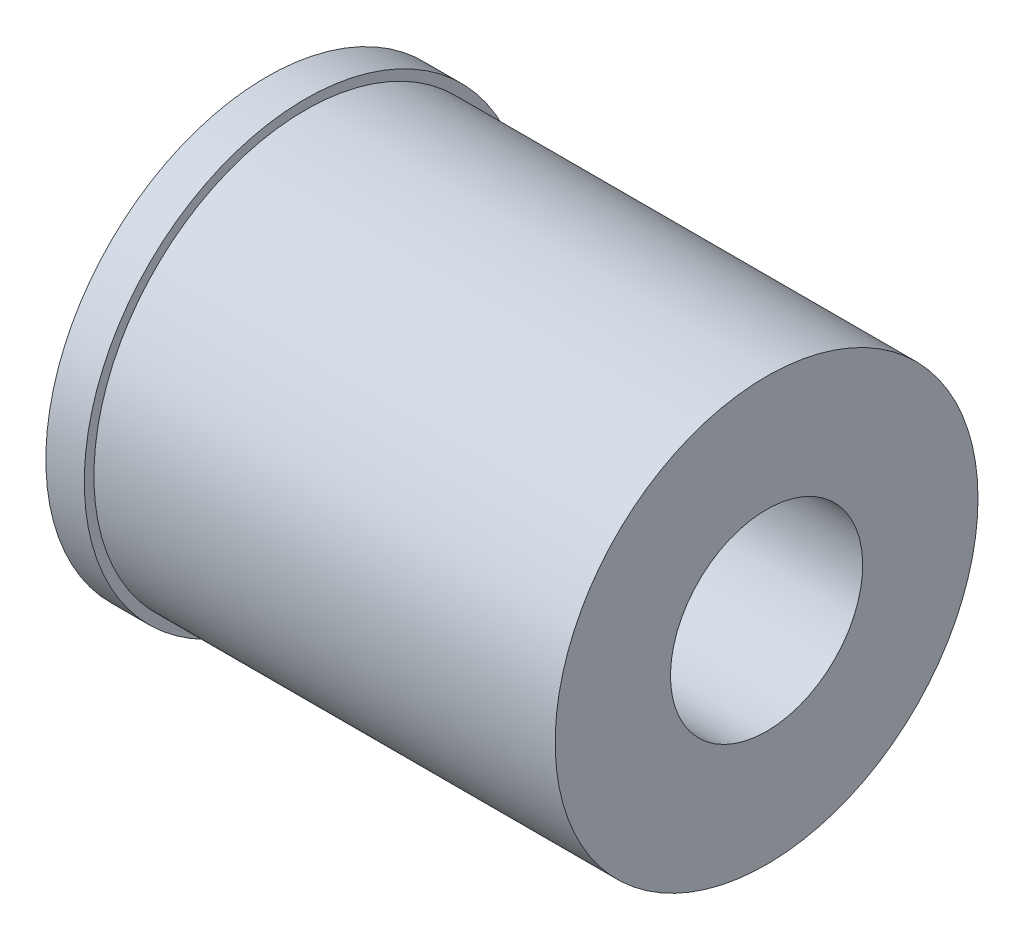
ISO-10303-21;
HEADER;
FILE_DESCRIPTION(('STEP AP214'),'2;1');
FILE_NAME('part.step','',(''),(''),'','','');
FILE_SCHEMA(('AUTOMOTIVE_DESIGN { 1 0 10303 214 1 1 1 1 }'));
ENDSEC;
DATA;
#1=APPLICATION_CONTEXT('core data for automotive mechanical design processes');
#2=APPLICATION_PROTOCOL_DEFINITION('international standard','automotive_design',2000,#1);
#3=PRODUCT_CONTEXT('',#1,'mechanical');
#4=PRODUCT('Part','Part','',(#3));
#5=PRODUCT_RELATED_PRODUCT_CATEGORY('part','',(#4));
#6=PRODUCT_DEFINITION_FORMATION('','',#4);
#7=PRODUCT_DEFINITION_CONTEXT('part definition',#1,'design');
#8=PRODUCT_DEFINITION('design','',#6,#7);
#9=PRODUCT_DEFINITION_SHAPE('','',#8);
#10=(LENGTH_UNIT() NAMED_UNIT(*) SI_UNIT(.MILLI.,.METRE.));
#11=(NAMED_UNIT(*) PLANE_ANGLE_UNIT() SI_UNIT($,.RADIAN.));
#12=(NAMED_UNIT(*) SI_UNIT($,.STERADIAN.) SOLID_ANGLE_UNIT());
#13=UNCERTAINTY_MEASURE_WITH_UNIT(LENGTH_MEASURE(1.E-05),#10,'distance_accuracy_value','');
#14=(GEOMETRIC_REPRESENTATION_CONTEXT(3) GLOBAL_UNCERTAINTY_ASSIGNED_CONTEXT((#13)) GLOBAL_UNIT_ASSIGNED_CONTEXT((#10,
#11,#12)) REPRESENTATION_CONTEXT('',''));
#15=CARTESIAN_POINT('',(0.,0.,0.));
#16=DIRECTION('',(0.,0.,1.));
#17=DIRECTION('',(1.,0.,0.));
#18=AXIS2_PLACEMENT_3D('',#15,#16,#17);
#19=CARTESIAN_POINT('',(-13.,0.,0.));
#20=DIRECTION('',(-1.,0.,0.));
#21=DIRECTION('',(0.,0.,1.));
#22=AXIS2_PLACEMENT_3D('',#19,#20,#21);
#23=PLANE('',#22);
#24=CARTESIAN_POINT('',(-13.,0.,0.));
#25=DIRECTION('',(-1.,0.,0.));
#26=DIRECTION('',(0.,-1.,0.));
#27=AXIS2_PLACEMENT_3D('',#24,#25,#26);
#28=CIRCLE('',#27,2.5);
#29=CARTESIAN_POINT('',(-13.,-2.5,0.));
#30=VERTEX_POINT('',#29);
#31=EDGE_CURVE('E58',#30,#30,#28,.T.);
#32=ORIENTED_EDGE('',*,*,#31,.F.);
#33=EDGE_LOOP('',(#32));
#34=FACE_BOUND('',#33,.T.);
#35=CARTESIAN_POINT('',(-13.,0.,0.));
#36=DIRECTION('',(1.,0.,0.));
#37=DIRECTION('',(0.,0.,-1.));
#38=AXIS2_PLACEMENT_3D('',#35,#36,#37);
#39=CIRCLE('',#38,5.75);
#40=CARTESIAN_POINT('',(-13.,0.,-5.75));
#41=VERTEX_POINT('',#40);
#42=EDGE_CURVE('E52',#41,#41,#39,.T.);
#43=ORIENTED_EDGE('',*,*,#42,.F.);
#44=EDGE_LOOP('',(#43));
#45=FACE_BOUND('',#44,.T.);
#46=ADVANCED_FACE('F37',(#34,#45),#23,.T.);
#47=CARTESIAN_POINT('',(0.,0.,0.));
#48=DIRECTION('',(1.,0.,0.));
#49=DIRECTION('',(0.,0.,-1.));
#50=AXIS2_PLACEMENT_3D('',#47,#48,#49);
#51=CYLINDRICAL_SURFACE('',#50,5.75);
#52=ORIENTED_EDGE('',*,*,#42,.T.);
#53=EDGE_LOOP('',(#52));
#54=FACE_BOUND('',#53,.T.);
#55=CARTESIAN_POINT('',(-12.,0.,0.));
#56=DIRECTION('',(1.,0.,0.));
#57=DIRECTION('',(0.,0.,-1.));
#58=AXIS2_PLACEMENT_3D('',#55,#56,#57);
#59=CIRCLE('',#58,5.75);
#60=CARTESIAN_POINT('',(-12.,0.,-5.75));
#61=VERTEX_POINT('',#60);
#62=EDGE_CURVE('E48',#61,#61,#59,.T.);
#63=ORIENTED_EDGE('',*,*,#62,.F.);
#64=EDGE_LOOP('',(#63));
#65=FACE_BOUND('',#64,.T.);
#66=ADVANCED_FACE('F73',(#54,#65),#51,.T.);
#67=CARTESIAN_POINT('',(-12.,0.,0.));
#68=DIRECTION('',(1.,0.,0.));
#69=DIRECTION('',(0.,0.,-1.));
#70=AXIS2_PLACEMENT_3D('',#67,#68,#69);
#71=PLANE('',#70);
#72=ORIENTED_EDGE('',*,*,#62,.T.);
#73=EDGE_LOOP('',(#72));
#74=FACE_BOUND('',#73,.T.);
#75=CARTESIAN_POINT('',(-12.,0.,0.));
#76=DIRECTION('',(1.,0.,0.));
#77=DIRECTION('',(0.,0.,-1.));
#78=AXIS2_PLACEMENT_3D('',#75,#76,#77);
#79=CIRCLE('',#78,5.5);
#80=CARTESIAN_POINT('',(-12.,0.,-5.5));
#81=VERTEX_POINT('',#80);
#82=EDGE_CURVE('E44',#81,#81,#79,.T.);
#83=ORIENTED_EDGE('',*,*,#82,.F.);
#84=EDGE_LOOP('',(#83));
#85=FACE_BOUND('',#84,.T.);
#86=ADVANCED_FACE('F75',(#74,#85),#71,.T.);
#87=CARTESIAN_POINT('',(0.,0.,0.));
#88=DIRECTION('',(1.,0.,0.));
#89=DIRECTION('',(0.,0.,-1.));
#90=AXIS2_PLACEMENT_3D('',#87,#88,#89);
#91=CYLINDRICAL_SURFACE('',#90,5.5);
#92=ORIENTED_EDGE('',*,*,#82,.T.);
#93=EDGE_LOOP('',(#92));
#94=FACE_BOUND('',#93,.T.);
#95=CARTESIAN_POINT('',(0.,0.,0.));
#96=DIRECTION('',(1.,0.,0.));
#97=DIRECTION('',(0.,0.,-1.));
#98=AXIS2_PLACEMENT_3D('',#95,#96,#97);
#99=CIRCLE('',#98,5.5);
#100=CARTESIAN_POINT('',(0.,0.,-5.5));
#101=VERTEX_POINT('',#100);
#102=EDGE_CURVE('E10',#101,#101,#99,.T.);
#103=ORIENTED_EDGE('',*,*,#102,.F.);
#104=EDGE_LOOP('',(#103));
#105=FACE_BOUND('',#104,.T.);
#106=ADVANCED_FACE('F85',(#94,#105),#91,.T.);
#107=CARTESIAN_POINT('',(0.,0.,0.));
#108=DIRECTION('',(1.,0.,0.));
#109=DIRECTION('',(0.,0.,-1.));
#110=AXIS2_PLACEMENT_3D('',#107,#108,#109);
#111=PLANE('',#110);
#112=CARTESIAN_POINT('',(0.,0.,0.));
#113=DIRECTION('',(-1.,0.,0.));
#114=DIRECTION('',(0.,-1.,0.));
#115=AXIS2_PLACEMENT_3D('',#112,#113,#114);
#116=CIRCLE('',#115,2.5);
#117=CARTESIAN_POINT('',(0.,-2.5,0.));
#118=VERTEX_POINT('',#117);
#119=EDGE_CURVE('E57',#118,#118,#116,.T.);
#120=ORIENTED_EDGE('',*,*,#119,.T.);
#121=EDGE_LOOP('',(#120));
#122=FACE_BOUND('',#121,.T.);
#123=ORIENTED_EDGE('',*,*,#102,.T.);
#124=EDGE_LOOP('',(#123));
#125=FACE_BOUND('',#124,.T.);
#126=ADVANCED_FACE('F39',(#122,#125),#111,.T.);
#127=CARTESIAN_POINT('',(0.,0.,0.));
#128=DIRECTION('',(-1.,0.,0.));
#129=DIRECTION('',(0.,-1.,0.));
#130=AXIS2_PLACEMENT_3D('',#127,#128,#129);
#131=CYLINDRICAL_SURFACE('',#130,2.5);
#132=ORIENTED_EDGE('',*,*,#119,.F.);
#133=EDGE_LOOP('',(#132));
#134=FACE_BOUND('',#133,.T.);
#135=ORIENTED_EDGE('',*,*,#31,.T.);
#136=EDGE_LOOP('',(#135));
#137=FACE_BOUND('',#136,.T.);
#138=ADVANCED_FACE('F65',(#134,#137),#131,.F.);
#139=CLOSED_SHELL('',(#46,#66,#86,#106,#126,#138));
#140=MANIFOLD_SOLID_BREP('B2',#139);
#141=ADVANCED_BREP_SHAPE_REPRESENTATION('',(#18,#140),#14);
#142=SHAPE_DEFINITION_REPRESENTATION(#9,#141);
ENDSEC;
END-ISO-10303-21;
